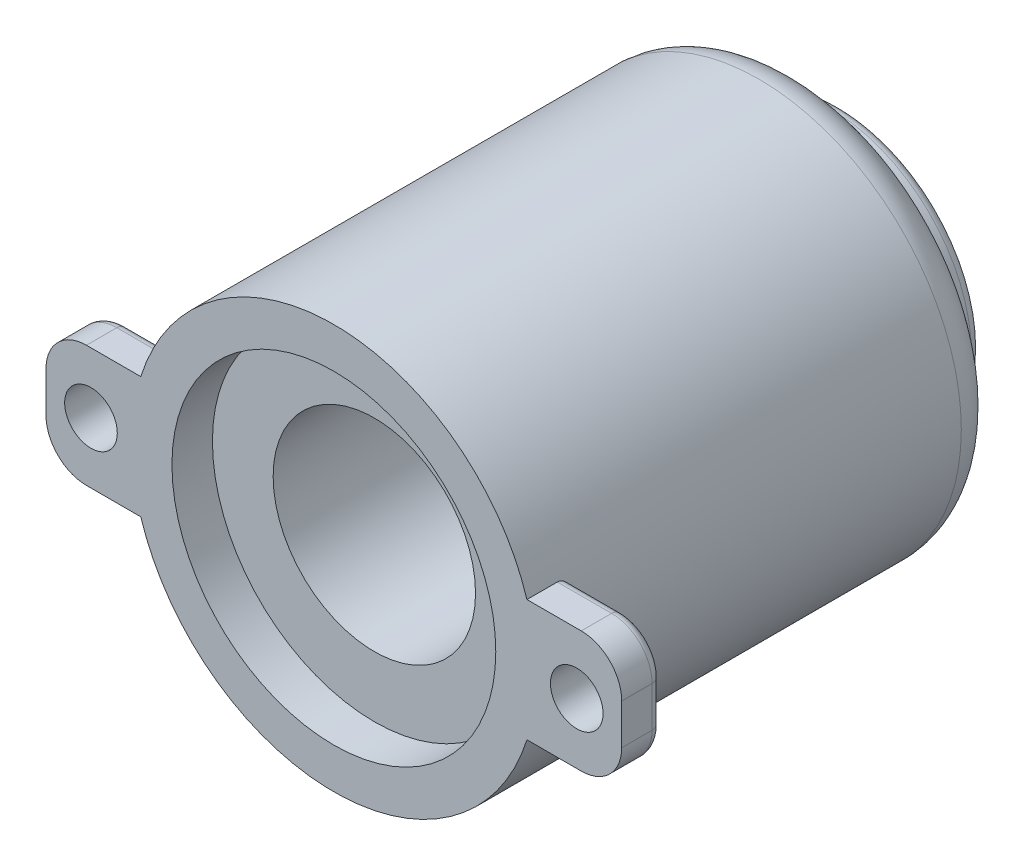
ISO-10303-21;
HEADER;
FILE_DESCRIPTION(('STEP AP214'),'2;1');
FILE_NAME('part.step','',(''),(''),'','','');
FILE_SCHEMA(('AUTOMOTIVE_DESIGN { 1 0 10303 214 1 1 1 1 }'));
ENDSEC;
DATA;
#1=APPLICATION_CONTEXT('core data for automotive mechanical design processes');
#2=APPLICATION_PROTOCOL_DEFINITION('international standard','automotive_design',2000,#1);
#3=PRODUCT_CONTEXT('',#1,'mechanical');
#4=PRODUCT('Part','Part','',(#3));
#5=PRODUCT_RELATED_PRODUCT_CATEGORY('part','',(#4));
#6=PRODUCT_DEFINITION_FORMATION('','',#4);
#7=PRODUCT_DEFINITION_CONTEXT('part definition',#1,'design');
#8=PRODUCT_DEFINITION('design','',#6,#7);
#9=PRODUCT_DEFINITION_SHAPE('','',#8);
#10=(LENGTH_UNIT() NAMED_UNIT(*) SI_UNIT(.MILLI.,.METRE.));
#11=(NAMED_UNIT(*) PLANE_ANGLE_UNIT() SI_UNIT($,.RADIAN.));
#12=(NAMED_UNIT(*) SI_UNIT($,.STERADIAN.) SOLID_ANGLE_UNIT());
#13=UNCERTAINTY_MEASURE_WITH_UNIT(LENGTH_MEASURE(1.E-05),#10,'distance_accuracy_value','');
#14=(GEOMETRIC_REPRESENTATION_CONTEXT(3) GLOBAL_UNCERTAINTY_ASSIGNED_CONTEXT((#13)) GLOBAL_UNIT_ASSIGNED_CONTEXT((#10,
#11,#12)) REPRESENTATION_CONTEXT('',''));
#15=CARTESIAN_POINT('',(0.,0.,0.));
#16=DIRECTION('',(0.,0.,1.));
#17=DIRECTION('',(1.,0.,0.));
#18=AXIS2_PLACEMENT_3D('',#15,#16,#17);
#19=CARTESIAN_POINT('',(0.,0.,25.));
#20=DIRECTION('',(0.,0.,-1.));
#21=DIRECTION('',(-1.,0.,0.));
#22=AXIS2_PLACEMENT_3D('',#19,#20,#21);
#23=CYLINDRICAL_SURFACE('',#22,10.);
#24=CARTESIAN_POINT('',(0.,0.,4.));
#25=DIRECTION('',(0.,0.,1.));
#26=DIRECTION('',(1.,0.,0.));
#27=AXIS2_PLACEMENT_3D('',#24,#25,#26);
#28=CIRCLE('',#27,10.);
#29=CARTESIAN_POINT('',(10.,0.,4.));
#30=VERTEX_POINT('',#29);
#31=EDGE_CURVE('E257',#30,#30,#28,.T.);
#32=ORIENTED_EDGE('',*,*,#31,.T.);
#33=EDGE_LOOP('',(#32));
#34=FACE_BOUND('',#33,.T.);
#35=CARTESIAN_POINT('',(0.,0.,23.));
#36=DIRECTION('',(0.,0.,1.));
#37=DIRECTION('',(1.,0.,0.));
#38=AXIS2_PLACEMENT_3D('',#35,#36,#37);
#39=CIRCLE('',#38,10.);
#40=CARTESIAN_POINT('',(9.68245836551854,-2.5,23.));
#41=VERTEX_POINT('',#40);
#42=CARTESIAN_POINT('',(9.68245836551854,2.5,23.));
#43=VERTEX_POINT('',#42);
#44=EDGE_CURVE('E202',#41,#43,#39,.T.);
#45=ORIENTED_EDGE('',*,*,#44,.F.);
#46=CARTESIAN_POINT('',(9.68245836551854,-2.5,23.));
#47=CARTESIAN_POINT('',(9.67496480250479,-2.52904312520752,22.9999809249249));
#48=CARTESIAN_POINT('',(9.66733257783533,-2.55804270438301,23.0025292417632));
#49=CARTESIAN_POINT('',(9.65203560335509,-2.61515873053145,23.0125843363903));
#50=CARTESIAN_POINT('',(9.6443708562301,-2.64327524887845,23.0200907123544));
#51=CARTESIAN_POINT('',(9.6292485010054,-2.69784793644394,23.0398906845954));
#52=CARTESIAN_POINT('',(9.62179100011823,-2.7243032548871,23.0521867110189));
#53=CARTESIAN_POINT('',(9.60735875051167,-2.77476938251723,23.0812531335548));
#54=CARTESIAN_POINT('',(9.60038386273843,-2.79878089677702,23.0980222340361));
#55=CARTESIAN_POINT('',(9.58725880346316,-2.8434145035181,23.1354367391875));
#56=CARTESIAN_POINT('',(9.58110130348199,-2.86406715053218,23.1560430573019));
#57=CARTESIAN_POINT('',(9.56980490864903,-2.90158903540323,23.2007069097613));
#58=CARTESIAN_POINT('',(9.56466606932191,-2.91845806703138,23.2247646321105));
#59=CARTESIAN_POINT('',(9.5558251694558,-2.94727419921496,23.2747269197597));
#60=CARTESIAN_POINT('',(9.55207820121579,-2.95937608351388,23.3005343437313));
#61=CARTESIAN_POINT('',(9.54596349204052,-2.97904150902355,23.3539625052951));
#62=CARTESIAN_POINT('',(9.54359402364106,-2.98661073480915,23.3815809231922));
#63=CARTESIAN_POINT('',(9.54111817225751,-2.99450689468364,23.424547371884));
#64=CARTESIAN_POINT('',(9.54047156850403,-2.99656561493198,23.4395667258843));
#65=CARTESIAN_POINT('',(9.53960853806577,-2.99931156393385,23.4697213938149));
#66=CARTESIAN_POINT('',(9.53939151438613,-3.00000069603307,23.4848565174323));
#67=CARTESIAN_POINT('',(9.53939201416956,-3.00000000000009,23.5));
#68=B_SPLINE_CURVE_WITH_KNOTS('',3,(#46,#47,#48,#49,#50,#51,#52,#53,#54,#55,#56,#57,#58,#59,#60,
#61,#62,#63,#64,#65,#66,#67),.UNSPECIFIED.,.F.,.F.,(4,2,2,2,2,2,2,2,2,2,4),(0.,
0.0898647569337993,0.179722231690332,0.269625357347482,0.35950247068271,0.448509731321384,
0.537521842190308,0.623342557815322,0.709055415854326,0.754515495626762,0.799912354261763),.UNSPECIFIED.);
#69=CARTESIAN_POINT('',(9.53939201416946,-3.,23.5));
#70=VERTEX_POINT('',#69);
#71=EDGE_CURVE('E321',#41,#70,#68,.T.);
#72=ORIENTED_EDGE('',*,*,#71,.T.);
#73=DIRECTION('',(0.,0.,1.));
#74=VECTOR('',#73,1.);
#75=CARTESIAN_POINT('',(9.53939201416946,-3.,23.));
#76=LINE('',#75,#74);
#77=CARTESIAN_POINT('',(9.53939201416946,-3.,25.));
#78=VERTEX_POINT('',#77);
#79=EDGE_CURVE('E210',#70,#78,#76,.T.);
#80=ORIENTED_EDGE('',*,*,#79,.T.);
#81=CARTESIAN_POINT('',(0.,0.,25.));
#82=DIRECTION('',(0.,0.,1.));
#83=DIRECTION('',(1.,0.,0.));
#84=AXIS2_PLACEMENT_3D('',#81,#82,#83);
#85=CIRCLE('',#84,10.);
#86=CARTESIAN_POINT('',(-9.53939201416946,-3.,25.));
#87=VERTEX_POINT('',#86);
#88=EDGE_CURVE('E255',#87,#78,#85,.T.);
#89=ORIENTED_EDGE('',*,*,#88,.F.);
#90=DIRECTION('',(0.,0.,1.));
#91=VECTOR('',#90,1.);
#92=CARTESIAN_POINT('',(-9.53939201416946,-3.,23.));
#93=LINE('',#92,#91);
#94=CARTESIAN_POINT('',(-9.53939201416946,-3.,23.5));
#95=VERTEX_POINT('',#94);
#96=EDGE_CURVE('E246',#95,#87,#93,.T.);
#97=ORIENTED_EDGE('',*,*,#96,.F.);
#98=CARTESIAN_POINT('',(-9.53939201416946,-3.,23.5));
#99=CARTESIAN_POINT('',(-9.53937998582246,-3.00002764626624,23.4727578056482));
#100=CARTESIAN_POINT('',(-9.5400915682234,-2.99777546092035,23.4455315693358));
#101=CARTESIAN_POINT('',(-9.54286960480183,-2.98892586751917,23.3919245130336));
#102=CARTESIAN_POINT('',(-9.54493309732231,-2.98233795768071,23.3655419769356));
#103=CARTESIAN_POINT('',(-9.55032323362511,-2.96503000267155,23.3143112637024));
#104=CARTESIAN_POINT('',(-9.55364982889329,-2.95431011620447,23.2894630276793));
#105=CARTESIAN_POINT('',(-9.56140799684489,-2.92910422732398,23.2419442946284));
#106=CARTESIAN_POINT('',(-9.56583982910627,-2.91461734015187,23.2192743109239));
#107=CARTESIAN_POINT('',(-9.57572561699523,-2.88197410245127,23.1762073585214));
#108=CARTESIAN_POINT('',(-9.58119952588392,-2.86374545894977,23.1558698413064));
#109=CARTESIAN_POINT('',(-9.59288472806633,-2.82435554424261,23.1185152404474));
#110=CARTESIAN_POINT('',(-9.59909623350931,-2.80319342901054,23.1014991158487));
#111=CARTESIAN_POINT('',(-9.61230665838635,-2.7575618993564,23.070518531096));
#112=CARTESIAN_POINT('',(-9.61932780455282,-2.73299025820295,23.056714176232));
#113=CARTESIAN_POINT('',(-9.63368018877332,-2.68195971484797,23.0334415953598));
#114=CARTESIAN_POINT('',(-9.64101137155978,-2.6555011484401,23.0239726000537));
#115=CARTESIAN_POINT('',(-9.6540821661106,-2.60752135624452,23.0112170875056));
#116=CARTESIAN_POINT('',(-9.65980746012515,-2.5862339165488,23.0070174499662));
#117=CARTESIAN_POINT('',(-9.67119906651014,-2.54330667204816,23.001408430675));
#118=CARTESIAN_POINT('',(-9.67686544055937,-2.52166731313824,22.9999957590679));
#119=CARTESIAN_POINT('',(-9.68245836551854,-2.5,23.));
#120=B_SPLINE_CURVE_WITH_KNOTS('',3,(#98,#99,#100,#101,#102,#103,#104,#105,#106,#107,#108,#109,
#110,#111,#112,#113,#114,#115,#116,#117,#118,#119),.UNSPECIFIED.,.F.,.F.,(4,2,2,2,2,2,2,2,2,2,
4),(0.,0.0815998783671246,0.163021589295217,0.244440173237377,0.325877897332737,
0.409069101079116,0.492284290698277,0.579030096370842,0.66576050326004,0.732911753892095,
0.799983688737135),.UNSPECIFIED.);
#121=CARTESIAN_POINT('',(-9.68245836551854,-2.5,23.));
#122=VERTEX_POINT('',#121);
#123=EDGE_CURVE('E44',#95,#122,#120,.T.);
#124=ORIENTED_EDGE('',*,*,#123,.T.);
#125=CARTESIAN_POINT('',(0.,0.,23.));
#126=DIRECTION('',(0.,0.,1.));
#127=DIRECTION('',(1.,0.,0.));
#128=AXIS2_PLACEMENT_3D('',#125,#126,#127);
#129=CIRCLE('',#128,10.);
#130=CARTESIAN_POINT('',(-9.68245836551854,2.5,23.));
#131=VERTEX_POINT('',#130);
#132=EDGE_CURVE('E216',#131,#122,#129,.T.);
#133=ORIENTED_EDGE('',*,*,#132,.F.);
#134=CARTESIAN_POINT('',(-9.68245836551854,2.5,23.));
#135=CARTESIAN_POINT('',(-9.67496480250479,2.52904312520752,22.9999809249249));
#136=CARTESIAN_POINT('',(-9.66733257783533,2.55804270438301,23.0025292417632));
#137=CARTESIAN_POINT('',(-9.65203560335509,2.61515873053145,23.0125843363903));
#138=CARTESIAN_POINT('',(-9.6443708562301,2.64327524887845,23.0200907123544));
#139=CARTESIAN_POINT('',(-9.6292485010054,2.69784793644394,23.0398906845954));
#140=CARTESIAN_POINT('',(-9.62179100011823,2.7243032548871,23.0521867110189));
#141=CARTESIAN_POINT('',(-9.60735875051167,2.77476938251723,23.0812531335548));
#142=CARTESIAN_POINT('',(-9.60038386273843,2.79878089677702,23.0980222340361));
#143=CARTESIAN_POINT('',(-9.58725880346316,2.8434145035181,23.1354367391875));
#144=CARTESIAN_POINT('',(-9.58110130348199,2.86406715053218,23.1560430573019));
#145=CARTESIAN_POINT('',(-9.56980490864903,2.90158903540323,23.2007069097613));
#146=CARTESIAN_POINT('',(-9.56466606932191,2.91845806703138,23.2247646321105));
#147=CARTESIAN_POINT('',(-9.5558251694558,2.94727419921496,23.2747269197597));
#148=CARTESIAN_POINT('',(-9.55207820121579,2.95937608351388,23.3005343437313));
#149=CARTESIAN_POINT('',(-9.54596349204052,2.97904150902355,23.3539625052951));
#150=CARTESIAN_POINT('',(-9.54359402364106,2.98661073480915,23.3815809231922));
#151=CARTESIAN_POINT('',(-9.54111817225751,2.99450689468364,23.424547371884));
#152=CARTESIAN_POINT('',(-9.54047156850403,2.99656561493198,23.4395667258843));
#153=CARTESIAN_POINT('',(-9.53960853806577,2.99931156393385,23.4697213938149));
#154=CARTESIAN_POINT('',(-9.53939151438613,3.00000069603307,23.4848565174323));
#155=CARTESIAN_POINT('',(-9.53939201416956,3.00000000000009,23.5));
#156=B_SPLINE_CURVE_WITH_KNOTS('',3,(#134,#135,#136,#137,#138,#139,#140,#141,#142,#143,#144,
#145,#146,#147,#148,#149,#150,#151,#152,#153,#154,#155),.UNSPECIFIED.,.F.,.F.,(4,2,2,2,2,2,2,2,
2,2,4),(0.,0.0898647569337993,0.179722231690332,0.269625357347482,0.35950247068271,
0.448509731321384,0.537521842190308,0.623342557815322,0.709055415854326,0.754515495626762,
0.799912354261763),.UNSPECIFIED.);
#157=CARTESIAN_POINT('',(-9.53939201416946,3.,23.5));
#158=VERTEX_POINT('',#157);
#159=EDGE_CURVE('E11',#131,#158,#156,.T.);
#160=ORIENTED_EDGE('',*,*,#159,.T.);
#161=DIRECTION('',(0.,0.,1.));
#162=VECTOR('',#161,1.);
#163=CARTESIAN_POINT('',(-9.53939201416946,3.,23.));
#164=LINE('',#163,#162);
#165=CARTESIAN_POINT('',(-9.53939201416946,3.,25.));
#166=VERTEX_POINT('',#165);
#167=EDGE_CURVE('E244',#158,#166,#164,.T.);
#168=ORIENTED_EDGE('',*,*,#167,.T.);
#169=CARTESIAN_POINT('',(9.53939201416946,3.,25.));
#170=VERTEX_POINT('',#169);
#171=EDGE_CURVE('E258',#170,#166,#85,.T.);
#172=ORIENTED_EDGE('',*,*,#171,.F.);
#173=DIRECTION('',(0.,0.,1.));
#174=VECTOR('',#173,1.);
#175=CARTESIAN_POINT('',(9.53939201416946,3.,23.));
#176=LINE('',#175,#174);
#177=CARTESIAN_POINT('',(9.53939201416946,3.,23.5));
#178=VERTEX_POINT('',#177);
#179=EDGE_CURVE('E172',#178,#170,#176,.T.);
#180=ORIENTED_EDGE('',*,*,#179,.F.);
#181=CARTESIAN_POINT('',(9.53939201416946,3.,23.5));
#182=CARTESIAN_POINT('',(9.53937998582246,3.00002764626624,23.4727578056482));
#183=CARTESIAN_POINT('',(9.5400915682234,2.99777546092035,23.4455315693358));
#184=CARTESIAN_POINT('',(9.54286960480183,2.98892586751917,23.3919245130336));
#185=CARTESIAN_POINT('',(9.54493309732231,2.98233795768071,23.3655419769356));
#186=CARTESIAN_POINT('',(9.55032323362511,2.96503000267155,23.3143112637024));
#187=CARTESIAN_POINT('',(9.55364982889329,2.95431011620447,23.2894630276793));
#188=CARTESIAN_POINT('',(9.56140799684489,2.92910422732398,23.2419442946284));
#189=CARTESIAN_POINT('',(9.56583982910627,2.91461734015187,23.2192743109239));
#190=CARTESIAN_POINT('',(9.57572561699523,2.88197410245127,23.1762073585214));
#191=CARTESIAN_POINT('',(9.58119952588392,2.86374545894977,23.1558698413064));
#192=CARTESIAN_POINT('',(9.59288472806633,2.82435554424261,23.1185152404474));
#193=CARTESIAN_POINT('',(9.59909623350931,2.80319342901054,23.1014991158487));
#194=CARTESIAN_POINT('',(9.61230665838635,2.7575618993564,23.070518531096));
#195=CARTESIAN_POINT('',(9.61932780455282,2.73299025820295,23.056714176232));
#196=CARTESIAN_POINT('',(9.63368018877332,2.68195971484797,23.0334415953598));
#197=CARTESIAN_POINT('',(9.64101137155978,2.6555011484401,23.0239726000537));
#198=CARTESIAN_POINT('',(9.6540821661106,2.60752135624452,23.0112170875056));
#199=CARTESIAN_POINT('',(9.65980746012515,2.5862339165488,23.0070174499662));
#200=CARTESIAN_POINT('',(9.67119906651014,2.54330667204816,23.001408430675));
#201=CARTESIAN_POINT('',(9.67686544055937,2.52166731313824,22.9999957590679));
#202=CARTESIAN_POINT('',(9.68245836551854,2.5,23.));
#203=B_SPLINE_CURVE_WITH_KNOTS('',3,(#181,#182,#183,#184,#185,#186,#187,#188,#189,#190,#191,
#192,#193,#194,#195,#196,#197,#198,#199,#200,#201,#202),.UNSPECIFIED.,.F.,.F.,(4,2,2,2,2,2,2,2,
2,2,4),(0.,0.0815998783671246,0.163021589295217,0.244440173237377,0.325877897332737,
0.409069101079116,0.492284290698277,0.579030096370842,0.66576050326004,0.732911753892095,
0.799983688737135),.UNSPECIFIED.);
#204=EDGE_CURVE('E328',#178,#43,#203,.T.);
#205=ORIENTED_EDGE('',*,*,#204,.T.);
#206=EDGE_LOOP('',(#45,#72,#80,#89,#97,#124,#133,#160,#168,#172,#180,#205));
#207=FACE_BOUND('',#206,.T.);
#208=ADVANCED_FACE('F35',(#34,#207),#23,.T.);
#209=CARTESIAN_POINT('',(0.,0.,25.));
#210=DIRECTION('',(0.,0.,-1.));
#211=DIRECTION('',(-1.,0.,0.));
#212=AXIS2_PLACEMENT_3D('',#209,#210,#211);
#213=CYLINDRICAL_SURFACE('',#212,5.);
#214=CARTESIAN_POINT('',(0.,0.,0.));
#215=DIRECTION('',(0.,0.,1.));
#216=DIRECTION('',(1.,0.,0.));
#217=AXIS2_PLACEMENT_3D('',#214,#215,#216);
#218=CIRCLE('',#217,5.);
#219=CARTESIAN_POINT('',(5.,0.,0.));
#220=VERTEX_POINT('',#219);
#221=EDGE_CURVE('E259',#220,#220,#218,.F.);
#222=ORIENTED_EDGE('',*,*,#221,.T.);
#223=EDGE_LOOP('',(#222));
#224=FACE_BOUND('',#223,.T.);
#225=CARTESIAN_POINT('',(0.,0.,23.));
#226=DIRECTION('',(0.,0.,1.));
#227=DIRECTION('',(1.,0.,0.));
#228=AXIS2_PLACEMENT_3D('',#225,#226,#227);
#229=CIRCLE('',#228,5.);
#230=CARTESIAN_POINT('',(5.,0.,23.));
#231=VERTEX_POINT('',#230);
#232=EDGE_CURVE('E252',#231,#231,#229,.T.);
#233=ORIENTED_EDGE('',*,*,#232,.T.);
#234=EDGE_LOOP('',(#233));
#235=FACE_BOUND('',#234,.T.);
#236=ADVANCED_FACE('F392',(#224,#235),#213,.F.);
#237=CARTESIAN_POINT('',(0.,0.,0.));
#238=DIRECTION('',(0.,0.,1.));
#239=DIRECTION('',(1.,0.,0.));
#240=AXIS2_PLACEMENT_3D('',#237,#238,#239);
#241=PLANE('',#240);
#242=CARTESIAN_POINT('',(0.,0.,0.));
#243=DIRECTION('',(0.,0.,1.));
#244=DIRECTION('',(1.,0.,0.));
#245=AXIS2_PLACEMENT_3D('',#242,#243,#244);
#246=CIRCLE('',#245,6.5);
#247=CARTESIAN_POINT('',(6.5,0.,0.));
#248=VERTEX_POINT('',#247);
#249=EDGE_CURVE('E312',#248,#248,#246,.F.);
#250=ORIENTED_EDGE('',*,*,#249,.T.);
#251=EDGE_LOOP('',(#250));
#252=FACE_BOUND('',#251,.T.);
#253=ORIENTED_EDGE('',*,*,#221,.F.);
#254=EDGE_LOOP('',(#253));
#255=FACE_BOUND('',#254,.T.);
#256=ADVANCED_FACE('F397',(#252,#255),#241,.F.);
#257=CARTESIAN_POINT('',(0.,0.,25.));
#258=DIRECTION('',(0.,0.,1.));
#259=DIRECTION('',(1.,0.,0.));
#260=AXIS2_PLACEMENT_3D('',#257,#258,#259);
#261=PLANE('',#260);
#262=CARTESIAN_POINT('',(0.,0.,25.));
#263=DIRECTION('',(0.,0.,1.));
#264=DIRECTION('',(1.,0.,0.));
#265=AXIS2_PLACEMENT_3D('',#262,#263,#264);
#266=CIRCLE('',#265,8.);
#267=CARTESIAN_POINT('',(8.,0.,25.));
#268=VERTEX_POINT('',#267);
#269=EDGE_CURVE('E239',#268,#268,#266,.T.);
#270=ORIENTED_EDGE('',*,*,#269,.F.);
#271=EDGE_LOOP('',(#270));
#272=FACE_BOUND('',#271,.T.);
#273=ORIENTED_EDGE('',*,*,#88,.T.);
#274=DIRECTION('',(-1.,0.,0.));
#275=VECTOR('',#274,1.);
#276=CARTESIAN_POINT('',(0.,-3.,25.));
#277=LINE('',#276,#275);
#278=CARTESIAN_POINT('',(12.2224676545555,-3.,25.));
#279=VERTEX_POINT('',#278);
#280=EDGE_CURVE('E190',#279,#78,#277,.T.);
#281=ORIENTED_EDGE('',*,*,#280,.F.);
#282=CARTESIAN_POINT('',(12.2224676545555,-1.,25.));
#283=DIRECTION('',(0.,0.,1.));
#284=DIRECTION('',(1.,0.,0.));
#285=AXIS2_PLACEMENT_3D('',#282,#283,#284);
#286=CIRCLE('',#285,2.);
#287=CARTESIAN_POINT('',(14.2224676545555,-0.999999999999986,25.));
#288=VERTEX_POINT('',#287);
#289=EDGE_CURVE('E193',#279,#288,#286,.T.);
#290=ORIENTED_EDGE('',*,*,#289,.T.);
#291=DIRECTION('',(0.,1.,0.));
#292=VECTOR('',#291,1.);
#293=CARTESIAN_POINT('',(14.2224676545555,0.,25.));
#294=LINE('',#293,#292);
#295=CARTESIAN_POINT('',(14.2224676545555,0.999999999999986,25.));
#296=VERTEX_POINT('',#295);
#297=EDGE_CURVE('E185',#288,#296,#294,.T.);
#298=ORIENTED_EDGE('',*,*,#297,.T.);
#299=CARTESIAN_POINT('',(12.2224676545555,1.,25.));
#300=DIRECTION('',(0.,0.,1.));
#301=DIRECTION('',(1.,0.,0.));
#302=AXIS2_PLACEMENT_3D('',#299,#300,#301);
#303=CIRCLE('',#302,2.);
#304=CARTESIAN_POINT('',(12.2224676545555,3.,25.));
#305=VERTEX_POINT('',#304);
#306=EDGE_CURVE('E165',#305,#296,#303,.F.);
#307=ORIENTED_EDGE('',*,*,#306,.F.);
#308=DIRECTION('',(-1.,0.,0.));
#309=VECTOR('',#308,1.);
#310=CARTESIAN_POINT('',(0.,3.,25.));
#311=LINE('',#310,#309);
#312=EDGE_CURVE('E181',#305,#170,#311,.T.);
#313=ORIENTED_EDGE('',*,*,#312,.T.);
#314=ORIENTED_EDGE('',*,*,#171,.T.);
#315=DIRECTION('',(1.,0.,0.));
#316=VECTOR('',#315,1.);
#317=CARTESIAN_POINT('',(0.,3.,25.));
#318=LINE('',#317,#316);
#319=CARTESIAN_POINT('',(-12.2224676545555,3.,25.));
#320=VERTEX_POINT('',#319);
#321=EDGE_CURVE('E229',#320,#166,#318,.T.);
#322=ORIENTED_EDGE('',*,*,#321,.F.);
#323=CARTESIAN_POINT('',(-12.2224676545555,1.,25.));
#324=DIRECTION('',(0.,0.,1.));
#325=DIRECTION('',(1.,0.,0.));
#326=AXIS2_PLACEMENT_3D('',#323,#324,#325);
#327=CIRCLE('',#326,2.);
#328=CARTESIAN_POINT('',(-14.2224676545555,0.999999999999986,25.));
#329=VERTEX_POINT('',#328);
#330=EDGE_CURVE('E232',#320,#329,#327,.T.);
#331=ORIENTED_EDGE('',*,*,#330,.T.);
#332=DIRECTION('',(0.,1.,0.));
#333=VECTOR('',#332,1.);
#334=CARTESIAN_POINT('',(-14.2224676545555,0.,25.));
#335=LINE('',#334,#333);
#336=CARTESIAN_POINT('',(-14.2224676545555,-0.999999999999986,25.));
#337=VERTEX_POINT('',#336);
#338=EDGE_CURVE('E217',#337,#329,#335,.T.);
#339=ORIENTED_EDGE('',*,*,#338,.F.);
#340=CARTESIAN_POINT('',(-12.2224676545555,-1.,25.));
#341=DIRECTION('',(0.,0.,1.));
#342=DIRECTION('',(1.,0.,0.));
#343=AXIS2_PLACEMENT_3D('',#340,#341,#342);
#344=CIRCLE('',#343,2.);
#345=CARTESIAN_POINT('',(-12.2224676545555,-3.,25.));
#346=VERTEX_POINT('',#345);
#347=EDGE_CURVE('E223',#346,#337,#344,.F.);
#348=ORIENTED_EDGE('',*,*,#347,.F.);
#349=DIRECTION('',(1.,0.,0.));
#350=VECTOR('',#349,1.);
#351=CARTESIAN_POINT('',(0.,-3.,25.));
#352=LINE('',#351,#350);
#353=EDGE_CURVE('E226',#346,#87,#352,.T.);
#354=ORIENTED_EDGE('',*,*,#353,.T.);
#355=EDGE_LOOP('',(#273,#281,#290,#298,#307,#313,#314,#322,#331,#339,#348,#354));
#356=FACE_BOUND('',#355,.T.);
#357=CARTESIAN_POINT('',(-12.,0.,25.));
#358=DIRECTION('',(0.,0.,1.));
#359=DIRECTION('',(1.,0.,0.));
#360=AXIS2_PLACEMENT_3D('',#357,#358,#359);
#361=CIRCLE('',#360,1.3);
#362=CARTESIAN_POINT('',(-10.7,0.,25.));
#363=VERTEX_POINT('',#362);
#364=EDGE_CURVE('E205',#363,#363,#361,.T.);
#365=ORIENTED_EDGE('',*,*,#364,.F.);
#366=EDGE_LOOP('',(#365));
#367=FACE_BOUND('',#366,.T.);
#368=CARTESIAN_POINT('',(12.,0.,25.));
#369=DIRECTION('',(0.,0.,1.));
#370=DIRECTION('',(1.,0.,0.));
#371=AXIS2_PLACEMENT_3D('',#368,#369,#370);
#372=CIRCLE('',#371,1.3);
#373=CARTESIAN_POINT('',(13.3,0.,25.));
#374=VERTEX_POINT('',#373);
#375=EDGE_CURVE('E199',#374,#374,#372,.F.);
#376=ORIENTED_EDGE('',*,*,#375,.T.);
#377=EDGE_LOOP('',(#376));
#378=FACE_BOUND('',#377,.T.);
#379=ADVANCED_FACE('F178',(#272,#356,#367,#378),#261,.T.);
#380=CARTESIAN_POINT('',(0.,0.,2.));
#381=DIRECTION('',(0.,0.,-1.));
#382=DIRECTION('',(-1.,0.,0.));
#383=AXIS2_PLACEMENT_3D('',#380,#381,#382);
#384=CYLINDRICAL_SURFACE('',#383,7.);
#385=CARTESIAN_POINT('',(0.,0.,0.5));
#386=DIRECTION('',(0.,0.,1.));
#387=DIRECTION('',(1.,0.,0.));
#388=AXIS2_PLACEMENT_3D('',#385,#386,#387);
#389=CIRCLE('',#388,7.);
#390=CARTESIAN_POINT('',(7.,0.,0.5));
#391=VERTEX_POINT('',#390);
#392=EDGE_CURVE('E309',#391,#391,#389,.T.);
#393=ORIENTED_EDGE('',*,*,#392,.T.);
#394=EDGE_LOOP('',(#393));
#395=FACE_BOUND('',#394,.T.);
#396=CARTESIAN_POINT('',(0.,0.,1.5));
#397=DIRECTION('',(0.,0.,1.));
#398=DIRECTION('',(1.,0.,0.));
#399=AXIS2_PLACEMENT_3D('',#396,#397,#398);
#400=CIRCLE('',#399,7.);
#401=CARTESIAN_POINT('',(7.,0.,1.5));
#402=VERTEX_POINT('',#401);
#403=EDGE_CURVE('E306',#402,#402,#400,.F.);
#404=ORIENTED_EDGE('',*,*,#403,.T.);
#405=EDGE_LOOP('',(#404));
#406=FACE_BOUND('',#405,.T.);
#407=ADVANCED_FACE('F478',(#395,#406),#384,.T.);
#408=CARTESIAN_POINT('',(0.,0.,2.));
#409=DIRECTION('',(0.,0.,1.));
#410=DIRECTION('',(1.,0.,0.));
#411=AXIS2_PLACEMENT_3D('',#408,#409,#410);
#412=PLANE('',#411);
#413=CARTESIAN_POINT('',(0.,0.,2.));
#414=DIRECTION('',(0.,0.,1.));
#415=DIRECTION('',(1.,0.,0.));
#416=AXIS2_PLACEMENT_3D('',#413,#414,#415);
#417=CIRCLE('',#416,7.5);
#418=CARTESIAN_POINT('',(7.5,0.,2.));
#419=VERTEX_POINT('',#418);
#420=EDGE_CURVE('E315',#419,#419,#417,.T.);
#421=ORIENTED_EDGE('',*,*,#420,.T.);
#422=EDGE_LOOP('',(#421));
#423=FACE_BOUND('',#422,.T.);
#424=CARTESIAN_POINT('',(0.,0.,2.));
#425=DIRECTION('',(0.,0.,1.));
#426=DIRECTION('',(1.,0.,0.));
#427=AXIS2_PLACEMENT_3D('',#424,#425,#426);
#428=CIRCLE('',#427,8.);
#429=CARTESIAN_POINT('',(8.,0.,2.));
#430=VERTEX_POINT('',#429);
#431=EDGE_CURVE('E266',#430,#430,#428,.F.);
#432=ORIENTED_EDGE('',*,*,#431,.T.);
#433=EDGE_LOOP('',(#432));
#434=FACE_BOUND('',#433,.T.);
#435=ADVANCED_FACE('F474',(#423,#434),#412,.F.);
#436=CARTESIAN_POINT('',(0.,0.,23.));
#437=DIRECTION('',(0.,0.,1.));
#438=DIRECTION('',(1.,0.,0.));
#439=AXIS2_PLACEMENT_3D('',#436,#437,#438);
#440=CYLINDRICAL_SURFACE('',#439,8.);
#441=CARTESIAN_POINT('',(0.,0.,23.));
#442=DIRECTION('',(0.,0.,1.));
#443=DIRECTION('',(1.,0.,0.));
#444=AXIS2_PLACEMENT_3D('',#441,#442,#443);
#445=CIRCLE('',#444,8.);
#446=CARTESIAN_POINT('',(8.,0.,23.));
#447=VERTEX_POINT('',#446);
#448=EDGE_CURVE('E249',#447,#447,#445,.T.);
#449=ORIENTED_EDGE('',*,*,#448,.F.);
#450=EDGE_LOOP('',(#449));
#451=FACE_BOUND('',#450,.T.);
#452=ORIENTED_EDGE('',*,*,#269,.T.);
#453=EDGE_LOOP('',(#452));
#454=FACE_BOUND('',#453,.T.);
#455=ADVANCED_FACE('F470',(#451,#454),#440,.F.);
#456=CARTESIAN_POINT('',(0.,0.,23.));
#457=DIRECTION('',(0.,0.,1.));
#458=DIRECTION('',(1.,0.,0.));
#459=AXIS2_PLACEMENT_3D('',#456,#457,#458);
#460=PLANE('',#459);
#461=ORIENTED_EDGE('',*,*,#232,.F.);
#462=EDGE_LOOP('',(#461));
#463=FACE_BOUND('',#462,.T.);
#464=ORIENTED_EDGE('',*,*,#448,.T.);
#465=EDGE_LOOP('',(#464));
#466=FACE_BOUND('',#465,.T.);
#467=ADVANCED_FACE('F463',(#463,#466),#460,.T.);
#468=CARTESIAN_POINT('',(-12.2224676545555,-1.,23.));
#469=DIRECTION('',(0.,0.,1.));
#470=DIRECTION('',(1.,0.,0.));
#471=AXIS2_PLACEMENT_3D('',#468,#469,#470);
#472=CYLINDRICAL_SURFACE('',#471,2.);
#473=DIRECTION('',(0.,0.,1.));
#474=VECTOR('',#473,1.);
#475=CARTESIAN_POINT('',(-14.2224676545555,-0.999999999999986,23.));
#476=LINE('',#475,#474);
#477=CARTESIAN_POINT('',(-14.2224676545555,-0.999999999999986,23.5));
#478=VERTEX_POINT('',#477);
#479=EDGE_CURVE('E237',#478,#337,#476,.T.);
#480=ORIENTED_EDGE('',*,*,#479,.F.);
#481=CARTESIAN_POINT('',(-12.2224676545555,-1.,23.5));
#482=DIRECTION('',(0.,0.,1.));
#483=DIRECTION('',(1.,0.,0.));
#484=AXIS2_PLACEMENT_3D('',#481,#482,#483);
#485=CIRCLE('',#484,2.);
#486=CARTESIAN_POINT('',(-12.2224676545555,-3.,23.5));
#487=VERTEX_POINT('',#486);
#488=EDGE_CURVE('E300',#478,#487,#485,.T.);
#489=ORIENTED_EDGE('',*,*,#488,.T.);
#490=DIRECTION('',(0.,0.,1.));
#491=VECTOR('',#490,1.);
#492=CARTESIAN_POINT('',(-12.2224676545555,-3.,23.));
#493=LINE('',#492,#491);
#494=EDGE_CURVE('E220',#487,#346,#493,.T.);
#495=ORIENTED_EDGE('',*,*,#494,.T.);
#496=ORIENTED_EDGE('',*,*,#347,.T.);
#497=EDGE_LOOP('',(#480,#489,#495,#496));
#498=FACE_BOUND('',#497,.T.);
#499=ADVANCED_FACE('F449',(#498),#472,.T.);
#500=CARTESIAN_POINT('',(-14.2224676545555,0.,23.));
#501=DIRECTION('',(1.,0.,0.));
#502=DIRECTION('',(0.,0.,-1.));
#503=AXIS2_PLACEMENT_3D('',#500,#501,#502);
#504=PLANE('',#503);
#505=DIRECTION('',(0.,0.,1.));
#506=VECTOR('',#505,1.);
#507=CARTESIAN_POINT('',(-14.2224676545555,0.999999999999986,23.));
#508=LINE('',#507,#506);
#509=CARTESIAN_POINT('',(-14.2224676545555,0.999999999999986,23.5));
#510=VERTEX_POINT('',#509);
#511=EDGE_CURVE('E240',#510,#329,#508,.T.);
#512=ORIENTED_EDGE('',*,*,#511,.F.);
#513=DIRECTION('',(0.,1.,0.));
#514=VECTOR('',#513,1.);
#515=CARTESIAN_POINT('',(-14.2224676545555,0.,23.5));
#516=LINE('',#515,#514);
#517=EDGE_CURVE('E302',#510,#478,#516,.F.);
#518=ORIENTED_EDGE('',*,*,#517,.T.);
#519=ORIENTED_EDGE('',*,*,#479,.T.);
#520=ORIENTED_EDGE('',*,*,#338,.T.);
#521=EDGE_LOOP('',(#512,#518,#519,#520));
#522=FACE_BOUND('',#521,.T.);
#523=ADVANCED_FACE('F445',(#522),#504,.F.);
#524=CARTESIAN_POINT('',(-12.2224676545555,1.,23.));
#525=DIRECTION('',(0.,0.,1.));
#526=DIRECTION('',(1.,0.,0.));
#527=AXIS2_PLACEMENT_3D('',#524,#525,#526);
#528=CYLINDRICAL_SURFACE('',#527,2.);
#529=DIRECTION('',(0.,0.,1.));
#530=VECTOR('',#529,1.);
#531=CARTESIAN_POINT('',(-12.2224676545555,3.,23.));
#532=LINE('',#531,#530);
#533=CARTESIAN_POINT('',(-12.2224676545555,3.,23.5));
#534=VERTEX_POINT('',#533);
#535=EDGE_CURVE('E242',#534,#320,#532,.T.);
#536=ORIENTED_EDGE('',*,*,#535,.F.);
#537=CARTESIAN_POINT('',(-12.2224676545555,1.,23.5));
#538=DIRECTION('',(0.,0.,1.));
#539=DIRECTION('',(1.,0.,0.));
#540=AXIS2_PLACEMENT_3D('',#537,#538,#539);
#541=CIRCLE('',#540,2.);
#542=EDGE_CURVE('E304',#534,#510,#541,.T.);
#543=ORIENTED_EDGE('',*,*,#542,.T.);
#544=ORIENTED_EDGE('',*,*,#511,.T.);
#545=ORIENTED_EDGE('',*,*,#330,.F.);
#546=EDGE_LOOP('',(#536,#543,#544,#545));
#547=FACE_BOUND('',#546,.T.);
#548=ADVANCED_FACE('F448',(#547),#528,.T.);
#549=CARTESIAN_POINT('',(0.,3.,23.));
#550=DIRECTION('',(0.,-1.,0.));
#551=DIRECTION('',(0.,0.,-1.));
#552=AXIS2_PLACEMENT_3D('',#549,#550,#551);
#553=PLANE('',#552);
#554=ORIENTED_EDGE('',*,*,#167,.F.);
#555=DIRECTION('',(1.,0.,0.));
#556=VECTOR('',#555,1.);
#557=CARTESIAN_POINT('',(0.,3.,23.5));
#558=LINE('',#557,#556);
#559=EDGE_CURVE('E57',#158,#534,#558,.F.);
#560=ORIENTED_EDGE('',*,*,#559,.T.);
#561=ORIENTED_EDGE('',*,*,#535,.T.);
#562=ORIENTED_EDGE('',*,*,#321,.T.);
#563=EDGE_LOOP('',(#554,#560,#561,#562));
#564=FACE_BOUND('',#563,.T.);
#565=ADVANCED_FACE('F453',(#564),#553,.F.);
#566=CARTESIAN_POINT('',(-12.,0.,23.));
#567=DIRECTION('',(0.,0.,1.));
#568=DIRECTION('',(1.,0.,0.));
#569=AXIS2_PLACEMENT_3D('',#566,#567,#568);
#570=CYLINDRICAL_SURFACE('',#569,1.3);
#571=CARTESIAN_POINT('',(-12.,0.,23.));
#572=DIRECTION('',(0.,0.,1.));
#573=DIRECTION('',(1.,0.,0.));
#574=AXIS2_PLACEMENT_3D('',#571,#572,#573);
#575=CIRCLE('',#574,1.3);
#576=CARTESIAN_POINT('',(-10.7,0.,23.));
#577=VERTEX_POINT('',#576);
#578=EDGE_CURVE('E213',#577,#577,#575,.T.);
#579=ORIENTED_EDGE('',*,*,#578,.F.);
#580=EDGE_LOOP('',(#579));
#581=FACE_BOUND('',#580,.T.);
#582=ORIENTED_EDGE('',*,*,#364,.T.);
#583=EDGE_LOOP('',(#582));
#584=FACE_BOUND('',#583,.T.);
#585=ADVANCED_FACE('F457',(#581,#584),#570,.F.);
#586=CARTESIAN_POINT('',(0.,-3.,23.));
#587=DIRECTION('',(0.,-1.,0.));
#588=DIRECTION('',(0.,0.,-1.));
#589=AXIS2_PLACEMENT_3D('',#586,#587,#588);
#590=PLANE('',#589);
#591=ORIENTED_EDGE('',*,*,#494,.F.);
#592=DIRECTION('',(1.,0.,0.));
#593=VECTOR('',#592,1.);
#594=CARTESIAN_POINT('',(-9.53939201416946,-3.,23.5));
#595=LINE('',#594,#593);
#596=EDGE_CURVE('E287',#487,#95,#595,.T.);
#597=ORIENTED_EDGE('',*,*,#596,.T.);
#598=ORIENTED_EDGE('',*,*,#96,.T.);
#599=ORIENTED_EDGE('',*,*,#353,.F.);
#600=EDGE_LOOP('',(#591,#597,#598,#599));
#601=FACE_BOUND('',#600,.T.);
#602=ADVANCED_FACE('F443',(#601),#590,.T.);
#603=CARTESIAN_POINT('',(0.,0.,23.));
#604=DIRECTION('',(0.,0.,1.));
#605=DIRECTION('',(1.,0.,0.));
#606=AXIS2_PLACEMENT_3D('',#603,#604,#605);
#607=PLANE('',#606);
#608=ORIENTED_EDGE('',*,*,#578,.T.);
#609=EDGE_LOOP('',(#608));
#610=FACE_BOUND('',#609,.T.);
#611=ORIENTED_EDGE('',*,*,#132,.T.);
#612=DIRECTION('',(1.,0.,0.));
#613=VECTOR('',#612,1.);
#614=CARTESIAN_POINT('',(-12.2224676545555,-2.5,23.));
#615=LINE('',#614,#613);
#616=CARTESIAN_POINT('',(-12.2224676545555,-2.5,23.));
#617=VERTEX_POINT('',#616);
#618=EDGE_CURVE('E298',#122,#617,#615,.F.);
#619=ORIENTED_EDGE('',*,*,#618,.T.);
#620=CARTESIAN_POINT('',(-12.2224676545555,-1.,23.));
#621=DIRECTION('',(0.,0.,1.));
#622=DIRECTION('',(1.,0.,0.));
#623=AXIS2_PLACEMENT_3D('',#620,#621,#622);
#624=CIRCLE('',#623,1.5);
#625=CARTESIAN_POINT('',(-13.7224676545555,-0.999999999999989,23.));
#626=VERTEX_POINT('',#625);
#627=EDGE_CURVE('E296',#617,#626,#624,.F.);
#628=ORIENTED_EDGE('',*,*,#627,.T.);
#629=DIRECTION('',(0.,1.,0.));
#630=VECTOR('',#629,1.);
#631=CARTESIAN_POINT('',(-13.7224676545555,0.,23.));
#632=LINE('',#631,#630);
#633=CARTESIAN_POINT('',(-13.7224676545555,0.999999999999986,23.));
#634=VERTEX_POINT('',#633);
#635=EDGE_CURVE('E294',#626,#634,#632,.T.);
#636=ORIENTED_EDGE('',*,*,#635,.T.);
#637=CARTESIAN_POINT('',(-12.2224676545555,1.,23.));
#638=DIRECTION('',(0.,0.,1.));
#639=DIRECTION('',(1.,0.,0.));
#640=AXIS2_PLACEMENT_3D('',#637,#638,#639);
#641=CIRCLE('',#640,1.5);
#642=CARTESIAN_POINT('',(-12.2224676545555,2.5,23.));
#643=VERTEX_POINT('',#642);
#644=EDGE_CURVE('E292',#634,#643,#641,.F.);
#645=ORIENTED_EDGE('',*,*,#644,.T.);
#646=DIRECTION('',(1.,0.,0.));
#647=VECTOR('',#646,1.);
#648=CARTESIAN_POINT('',(0.,2.5,23.));
#649=LINE('',#648,#647);
#650=EDGE_CURVE('E290',#643,#131,#649,.T.);
#651=ORIENTED_EDGE('',*,*,#650,.T.);
#652=EDGE_LOOP('',(#611,#619,#628,#636,#645,#651));
#653=FACE_BOUND('',#652,.T.);
#654=ADVANCED_FACE('F440',(#610,#653),#607,.F.);
#655=CARTESIAN_POINT('',(12.2224676545555,1.,23.));
#656=DIRECTION('',(0.,0.,1.));
#657=DIRECTION('',(1.,0.,0.));
#658=AXIS2_PLACEMENT_3D('',#655,#656,#657);
#659=CYLINDRICAL_SURFACE('',#658,2.);
#660=DIRECTION('',(0.,0.,1.));
#661=VECTOR('',#660,1.);
#662=CARTESIAN_POINT('',(14.2224676545555,0.999999999999986,23.));
#663=LINE('',#662,#661);
#664=CARTESIAN_POINT('',(14.2224676545555,0.999999999999986,23.5));
#665=VERTEX_POINT('',#664);
#666=EDGE_CURVE('E203',#665,#296,#663,.T.);
#667=ORIENTED_EDGE('',*,*,#666,.F.);
#668=CARTESIAN_POINT('',(12.2224676545555,1.,23.5));
#669=DIRECTION('',(0.,0.,1.));
#670=DIRECTION('',(1.,0.,0.));
#671=AXIS2_PLACEMENT_3D('',#668,#669,#670);
#672=CIRCLE('',#671,2.);
#673=CARTESIAN_POINT('',(12.2224676545555,3.,23.5));
#674=VERTEX_POINT('',#673);
#675=EDGE_CURVE('E168',#665,#674,#672,.T.);
#676=ORIENTED_EDGE('',*,*,#675,.T.);
#677=DIRECTION('',(0.,0.,1.));
#678=VECTOR('',#677,1.);
#679=CARTESIAN_POINT('',(12.2224676545555,3.,23.));
#680=LINE('',#679,#678);
#681=EDGE_CURVE('E161',#674,#305,#680,.T.);
#682=ORIENTED_EDGE('',*,*,#681,.T.);
#683=ORIENTED_EDGE('',*,*,#306,.T.);
#684=EDGE_LOOP('',(#667,#676,#682,#683));
#685=FACE_BOUND('',#684,.T.);
#686=ADVANCED_FACE('F164',(#685),#659,.T.);
#687=CARTESIAN_POINT('',(14.2224676545555,0.,23.));
#688=DIRECTION('',(1.,0.,0.));
#689=DIRECTION('',(0.,0.,-1.));
#690=AXIS2_PLACEMENT_3D('',#687,#688,#689);
#691=PLANE('',#690);
#692=DIRECTION('',(0.,0.,1.));
#693=VECTOR('',#692,1.);
#694=CARTESIAN_POINT('',(14.2224676545555,-0.999999999999986,23.));
#695=LINE('',#694,#693);
#696=CARTESIAN_POINT('',(14.2224676545555,-0.999999999999986,23.5));
#697=VERTEX_POINT('',#696);
#698=EDGE_CURVE('E206',#697,#288,#695,.T.);
#699=ORIENTED_EDGE('',*,*,#698,.F.);
#700=DIRECTION('',(0.,1.,0.));
#701=VECTOR('',#700,1.);
#702=CARTESIAN_POINT('',(14.2224676545555,0.999999999999986,23.5));
#703=LINE('',#702,#701);
#704=EDGE_CURVE('E318',#697,#665,#703,.T.);
#705=ORIENTED_EDGE('',*,*,#704,.T.);
#706=ORIENTED_EDGE('',*,*,#666,.T.);
#707=ORIENTED_EDGE('',*,*,#297,.F.);
#708=EDGE_LOOP('',(#699,#705,#706,#707));
#709=FACE_BOUND('',#708,.T.);
#710=ADVANCED_FACE('F424',(#709),#691,.T.);
#711=CARTESIAN_POINT('',(12.2224676545555,-1.,23.));
#712=DIRECTION('',(0.,0.,1.));
#713=DIRECTION('',(1.,0.,0.));
#714=AXIS2_PLACEMENT_3D('',#711,#712,#713);
#715=CYLINDRICAL_SURFACE('',#714,2.);
#716=DIRECTION('',(0.,0.,1.));
#717=VECTOR('',#716,1.);
#718=CARTESIAN_POINT('',(12.2224676545555,-3.,23.));
#719=LINE('',#718,#717);
#720=CARTESIAN_POINT('',(12.2224676545555,-3.,23.5));
#721=VERTEX_POINT('',#720);
#722=EDGE_CURVE('E208',#721,#279,#719,.T.);
#723=ORIENTED_EDGE('',*,*,#722,.F.);
#724=CARTESIAN_POINT('',(12.2224676545555,-1.,23.5));
#725=DIRECTION('',(0.,0.,1.));
#726=DIRECTION('',(1.,0.,0.));
#727=AXIS2_PLACEMENT_3D('',#724,#725,#726);
#728=CIRCLE('',#727,2.);
#729=EDGE_CURVE('E282',#721,#697,#728,.T.);
#730=ORIENTED_EDGE('',*,*,#729,.T.);
#731=ORIENTED_EDGE('',*,*,#698,.T.);
#732=ORIENTED_EDGE('',*,*,#289,.F.);
#733=EDGE_LOOP('',(#723,#730,#731,#732));
#734=FACE_BOUND('',#733,.T.);
#735=ADVANCED_FACE('F427',(#734),#715,.T.);
#736=CARTESIAN_POINT('',(0.,-3.,23.));
#737=DIRECTION('',(0.,1.,0.));
#738=DIRECTION('',(0.,0.,1.));
#739=AXIS2_PLACEMENT_3D('',#736,#737,#738);
#740=PLANE('',#739);
#741=ORIENTED_EDGE('',*,*,#79,.F.);
#742=DIRECTION('',(-1.,0.,0.));
#743=VECTOR('',#742,1.);
#744=CARTESIAN_POINT('',(0.,-3.,23.5));
#745=LINE('',#744,#743);
#746=EDGE_CURVE('E280',#70,#721,#745,.F.);
#747=ORIENTED_EDGE('',*,*,#746,.T.);
#748=ORIENTED_EDGE('',*,*,#722,.T.);
#749=ORIENTED_EDGE('',*,*,#280,.T.);
#750=EDGE_LOOP('',(#741,#747,#748,#749));
#751=FACE_BOUND('',#750,.T.);
#752=ADVANCED_FACE('F431',(#751),#740,.F.);
#753=CARTESIAN_POINT('',(0.,3.,23.));
#754=DIRECTION('',(0.,1.,0.));
#755=DIRECTION('',(0.,0.,1.));
#756=AXIS2_PLACEMENT_3D('',#753,#754,#755);
#757=PLANE('',#756);
#758=ORIENTED_EDGE('',*,*,#681,.F.);
#759=DIRECTION('',(-1.,0.,0.));
#760=VECTOR('',#759,1.);
#761=CARTESIAN_POINT('',(9.53939201416946,3.,23.5));
#762=LINE('',#761,#760);
#763=EDGE_CURVE('E284',#674,#178,#762,.T.);
#764=ORIENTED_EDGE('',*,*,#763,.T.);
#765=ORIENTED_EDGE('',*,*,#179,.T.);
#766=ORIENTED_EDGE('',*,*,#312,.F.);
#767=EDGE_LOOP('',(#758,#764,#765,#766));
#768=FACE_BOUND('',#767,.T.);
#769=ADVANCED_FACE('F188',(#768),#757,.T.);
#770=CARTESIAN_POINT('',(12.,0.,23.));
#771=DIRECTION('',(0.,0.,1.));
#772=DIRECTION('',(1.,0.,0.));
#773=AXIS2_PLACEMENT_3D('',#770,#771,#772);
#774=CYLINDRICAL_SURFACE('',#773,1.3);
#775=CARTESIAN_POINT('',(12.,0.,23.));
#776=DIRECTION('',(0.,0.,1.));
#777=DIRECTION('',(1.,0.,0.));
#778=AXIS2_PLACEMENT_3D('',#775,#776,#777);
#779=CIRCLE('',#778,1.3);
#780=CARTESIAN_POINT('',(13.3,0.,23.));
#781=VERTEX_POINT('',#780);
#782=EDGE_CURVE('E173',#781,#781,#779,.F.);
#783=ORIENTED_EDGE('',*,*,#782,.T.);
#784=EDGE_LOOP('',(#783));
#785=FACE_BOUND('',#784,.T.);
#786=ORIENTED_EDGE('',*,*,#375,.F.);
#787=EDGE_LOOP('',(#786));
#788=FACE_BOUND('',#787,.T.);
#789=ADVANCED_FACE('F411',(#785,#788),#774,.F.);
#790=CARTESIAN_POINT('',(0.,0.,23.));
#791=DIRECTION('',(0.,0.,1.));
#792=DIRECTION('',(1.,0.,0.));
#793=AXIS2_PLACEMENT_3D('',#790,#791,#792);
#794=PLANE('',#793);
#795=CARTESIAN_POINT('',(12.2224676545555,-1.,23.));
#796=DIRECTION('',(0.,0.,1.));
#797=DIRECTION('',(1.,0.,0.));
#798=AXIS2_PLACEMENT_3D('',#795,#796,#797);
#799=CIRCLE('',#798,1.5);
#800=CARTESIAN_POINT('',(13.7224676545555,-0.999999999999989,23.));
#801=VERTEX_POINT('',#800);
#802=CARTESIAN_POINT('',(12.2224676545555,-2.5,23.));
#803=VERTEX_POINT('',#802);
#804=EDGE_CURVE('E275',#801,#803,#799,.F.);
#805=ORIENTED_EDGE('',*,*,#804,.T.);
#806=DIRECTION('',(-1.,0.,0.));
#807=VECTOR('',#806,1.);
#808=CARTESIAN_POINT('',(0.,-2.5,23.));
#809=LINE('',#808,#807);
#810=EDGE_CURVE('E277',#803,#41,#809,.T.);
#811=ORIENTED_EDGE('',*,*,#810,.T.);
#812=ORIENTED_EDGE('',*,*,#44,.T.);
#813=DIRECTION('',(-1.,0.,0.));
#814=VECTOR('',#813,1.);
#815=CARTESIAN_POINT('',(12.2224676545555,2.5,23.));
#816=LINE('',#815,#814);
#817=CARTESIAN_POINT('',(12.2224676545555,2.5,23.));
#818=VERTEX_POINT('',#817);
#819=EDGE_CURVE('E273',#43,#818,#816,.F.);
#820=ORIENTED_EDGE('',*,*,#819,.T.);
#821=CARTESIAN_POINT('',(12.2224676545555,1.,23.));
#822=DIRECTION('',(0.,0.,1.));
#823=DIRECTION('',(1.,0.,0.));
#824=AXIS2_PLACEMENT_3D('',#821,#822,#823);
#825=CIRCLE('',#824,1.5);
#826=CARTESIAN_POINT('',(13.7224676545555,0.999999999999989,23.));
#827=VERTEX_POINT('',#826);
#828=EDGE_CURVE('E271',#818,#827,#825,.F.);
#829=ORIENTED_EDGE('',*,*,#828,.T.);
#830=DIRECTION('',(0.,1.,0.));
#831=VECTOR('',#830,1.);
#832=CARTESIAN_POINT('',(13.7224676545555,-0.999999999999986,23.));
#833=LINE('',#832,#831);
#834=EDGE_CURVE('E269',#827,#801,#833,.F.);
#835=ORIENTED_EDGE('',*,*,#834,.T.);
#836=EDGE_LOOP('',(#805,#811,#812,#820,#829,#835));
#837=FACE_BOUND('',#836,.T.);
#838=ORIENTED_EDGE('',*,*,#782,.F.);
#839=EDGE_LOOP('',(#838));
#840=FACE_BOUND('',#839,.T.);
#841=ADVANCED_FACE('F414',(#837,#840),#794,.F.);
#842=CARTESIAN_POINT('',(0.,0.,4.));
#843=DIRECTION('',(0.,0.,1.));
#844=DIRECTION('',(1.,0.,0.));
#845=AXIS2_PLACEMENT_3D('',#842,#843,#844);
#846=TOROIDAL_SURFACE('',#845,8.,2.);
#847=ORIENTED_EDGE('',*,*,#431,.F.);
#848=EDGE_LOOP('',(#847));
#849=FACE_BOUND('',#848,.T.);
#850=ORIENTED_EDGE('',*,*,#31,.F.);
#851=EDGE_LOOP('',(#850));
#852=FACE_BOUND('',#851,.T.);
#853=ADVANCED_FACE('F344',(#849,#852),#846,.T.);
#854=CARTESIAN_POINT('',(0.,2.5,23.5));
#855=DIRECTION('',(1.,0.,0.));
#856=DIRECTION('',(0.,0.,-1.));
#857=AXIS2_PLACEMENT_3D('',#854,#855,#856);
#858=CYLINDRICAL_SURFACE('',#857,0.5);
#859=ORIENTED_EDGE('',*,*,#204,.F.);
#860=ORIENTED_EDGE('',*,*,#763,.F.);
#861=CARTESIAN_POINT('',(12.2224676545555,2.5,23.5));
#862=DIRECTION('',(1.,0.,0.));
#863=DIRECTION('',(0.,0.,-1.));
#864=AXIS2_PLACEMENT_3D('',#861,#862,#863);
#865=CIRCLE('',#864,0.5);
#866=EDGE_CURVE('E186',#818,#674,#865,.T.);
#867=ORIENTED_EDGE('',*,*,#866,.F.);
#868=ORIENTED_EDGE('',*,*,#819,.F.);
#869=EDGE_LOOP('',(#859,#860,#867,#868));
#870=FACE_BOUND('',#869,.T.);
#871=ADVANCED_FACE('F354',(#870),#858,.T.);
#872=CARTESIAN_POINT('',(12.2224676545555,1.,23.5));
#873=DIRECTION('',(0.,0.,1.));
#874=DIRECTION('',(1.,0.,0.));
#875=AXIS2_PLACEMENT_3D('',#872,#873,#874);
#876=TOROIDAL_SURFACE('',#875,1.5,0.5);
#877=ORIENTED_EDGE('',*,*,#866,.T.);
#878=ORIENTED_EDGE('',*,*,#675,.F.);
#879=CARTESIAN_POINT('',(13.7224676545555,0.999999999999989,23.5));
#880=DIRECTION('',(0.,-1.,0.));
#881=DIRECTION('',(1.,0.,0.));
#882=AXIS2_PLACEMENT_3D('',#879,#880,#881);
#883=CIRCLE('',#882,0.5);
#884=EDGE_CURVE('E735',#827,#665,#883,.T.);
#885=ORIENTED_EDGE('',*,*,#884,.F.);
#886=ORIENTED_EDGE('',*,*,#828,.F.);
#887=EDGE_LOOP('',(#877,#878,#885,#886));
#888=FACE_BOUND('',#887,.T.);
#889=ADVANCED_FACE('F351',(#888),#876,.T.);
#890=CARTESIAN_POINT('',(13.7224676545555,0.,23.5));
#891=DIRECTION('',(0.,-1.,0.));
#892=DIRECTION('',(0.,0.,-1.));
#893=AXIS2_PLACEMENT_3D('',#890,#891,#892);
#894=CYLINDRICAL_SURFACE('',#893,0.5);
#895=ORIENTED_EDGE('',*,*,#884,.T.);
#896=ORIENTED_EDGE('',*,*,#704,.F.);
#897=CARTESIAN_POINT('',(13.7224676545555,-0.999999999999989,23.5));
#898=DIRECTION('',(0.,-1.,0.));
#899=DIRECTION('',(1.,0.,0.));
#900=AXIS2_PLACEMENT_3D('',#897,#898,#899);
#901=CIRCLE('',#900,0.5);
#902=EDGE_CURVE('E737',#801,#697,#901,.T.);
#903=ORIENTED_EDGE('',*,*,#902,.F.);
#904=ORIENTED_EDGE('',*,*,#834,.F.);
#905=EDGE_LOOP('',(#895,#896,#903,#904));
#906=FACE_BOUND('',#905,.T.);
#907=ADVANCED_FACE('F347',(#906),#894,.T.);
#908=CARTESIAN_POINT('',(12.2224676545555,-1.,23.5));
#909=DIRECTION('',(0.,0.,1.));
#910=DIRECTION('',(1.,0.,0.));
#911=AXIS2_PLACEMENT_3D('',#908,#909,#910);
#912=TOROIDAL_SURFACE('',#911,1.5,0.5);
#913=ORIENTED_EDGE('',*,*,#902,.T.);
#914=ORIENTED_EDGE('',*,*,#729,.F.);
#915=CARTESIAN_POINT('',(12.2224676545555,-2.5,23.5));
#916=DIRECTION('',(-1.,0.,0.));
#917=DIRECTION('',(0.,0.,1.));
#918=AXIS2_PLACEMENT_3D('',#915,#916,#917);
#919=CIRCLE('',#918,0.5);
#920=EDGE_CURVE('E376',#803,#721,#919,.T.);
#921=ORIENTED_EDGE('',*,*,#920,.F.);
#922=ORIENTED_EDGE('',*,*,#804,.F.);
#923=EDGE_LOOP('',(#913,#914,#921,#922));
#924=FACE_BOUND('',#923,.T.);
#925=ADVANCED_FACE('F342',(#924),#912,.T.);
#926=CARTESIAN_POINT('',(0.,-2.5,23.5));
#927=DIRECTION('',(-1.,0.,0.));
#928=DIRECTION('',(0.,0.,1.));
#929=AXIS2_PLACEMENT_3D('',#926,#927,#928);
#930=CYLINDRICAL_SURFACE('',#929,0.5);
#931=ORIENTED_EDGE('',*,*,#920,.T.);
#932=ORIENTED_EDGE('',*,*,#746,.F.);
#933=ORIENTED_EDGE('',*,*,#71,.F.);
#934=ORIENTED_EDGE('',*,*,#810,.F.);
#935=EDGE_LOOP('',(#931,#932,#933,#934));
#936=FACE_BOUND('',#935,.T.);
#937=ADVANCED_FACE('F337',(#936),#930,.T.);
#938=CARTESIAN_POINT('',(0.,2.5,23.5));
#939=DIRECTION('',(1.,0.,0.));
#940=DIRECTION('',(0.,0.,-1.));
#941=AXIS2_PLACEMENT_3D('',#938,#939,#940);
#942=CYLINDRICAL_SURFACE('',#941,0.5);
#943=ORIENTED_EDGE('',*,*,#159,.F.);
#944=ORIENTED_EDGE('',*,*,#650,.F.);
#945=CARTESIAN_POINT('',(-12.2224676545555,2.5,23.5));
#946=DIRECTION('',(-1.,0.,0.));
#947=DIRECTION('',(0.,0.,1.));
#948=AXIS2_PLACEMENT_3D('',#945,#946,#947);
#949=CIRCLE('',#948,0.5);
#950=EDGE_CURVE('E39',#534,#643,#949,.T.);
#951=ORIENTED_EDGE('',*,*,#950,.F.);
#952=ORIENTED_EDGE('',*,*,#559,.F.);
#953=EDGE_LOOP('',(#943,#944,#951,#952));
#954=FACE_BOUND('',#953,.T.);
#955=ADVANCED_FACE('F341',(#954),#942,.T.);
#956=CARTESIAN_POINT('',(-12.2224676545555,1.,23.5));
#957=DIRECTION('',(0.,0.,1.));
#958=DIRECTION('',(1.,0.,0.));
#959=AXIS2_PLACEMENT_3D('',#956,#957,#958);
#960=TOROIDAL_SURFACE('',#959,1.5,0.5);
#961=ORIENTED_EDGE('',*,*,#950,.T.);
#962=ORIENTED_EDGE('',*,*,#644,.F.);
#963=CARTESIAN_POINT('',(-13.7224676545555,0.999999999999989,23.5));
#964=DIRECTION('',(0.,-1.,0.));
#965=DIRECTION('',(0.,0.,-1.));
#966=AXIS2_PLACEMENT_3D('',#963,#964,#965);
#967=CIRCLE('',#966,0.5);
#968=EDGE_CURVE('E727',#510,#634,#967,.T.);
#969=ORIENTED_EDGE('',*,*,#968,.F.);
#970=ORIENTED_EDGE('',*,*,#542,.F.);
#971=EDGE_LOOP('',(#961,#962,#969,#970));
#972=FACE_BOUND('',#971,.T.);
#973=ADVANCED_FACE('F381',(#972),#960,.T.);
#974=CARTESIAN_POINT('',(-13.7224676545555,0.,23.5));
#975=DIRECTION('',(0.,1.,0.));
#976=DIRECTION('',(0.,0.,1.));
#977=AXIS2_PLACEMENT_3D('',#974,#975,#976);
#978=CYLINDRICAL_SURFACE('',#977,0.5);
#979=ORIENTED_EDGE('',*,*,#968,.T.);
#980=ORIENTED_EDGE('',*,*,#635,.F.);
#981=CARTESIAN_POINT('',(-13.7224676545555,-0.999999999999986,23.5));
#982=DIRECTION('',(0.,-1.,0.));
#983=DIRECTION('',(0.,0.,-1.));
#984=AXIS2_PLACEMENT_3D('',#981,#982,#983);
#985=CIRCLE('',#984,0.5);
#986=EDGE_CURVE('E722',#478,#626,#985,.T.);
#987=ORIENTED_EDGE('',*,*,#986,.F.);
#988=ORIENTED_EDGE('',*,*,#517,.F.);
#989=EDGE_LOOP('',(#979,#980,#987,#988));
#990=FACE_BOUND('',#989,.T.);
#991=ADVANCED_FACE('F669',(#990),#978,.T.);
#992=CARTESIAN_POINT('',(-12.2224676545555,-1.,23.5));
#993=DIRECTION('',(0.,0.,1.));
#994=DIRECTION('',(1.,0.,0.));
#995=AXIS2_PLACEMENT_3D('',#992,#993,#994);
#996=TOROIDAL_SURFACE('',#995,1.5,0.5);
#997=ORIENTED_EDGE('',*,*,#986,.T.);
#998=ORIENTED_EDGE('',*,*,#627,.F.);
#999=CARTESIAN_POINT('',(-12.2224676545555,-2.5,23.5));
#1000=DIRECTION('',(1.,0.,0.));
#1001=DIRECTION('',(0.,1.,0.));
#1002=AXIS2_PLACEMENT_3D('',#999,#1000,#1001);
#1003=CIRCLE('',#1002,0.5);
#1004=EDGE_CURVE('E728',#487,#617,#1003,.T.);
#1005=ORIENTED_EDGE('',*,*,#1004,.F.);
#1006=ORIENTED_EDGE('',*,*,#488,.F.);
#1007=EDGE_LOOP('',(#997,#998,#1005,#1006));
#1008=FACE_BOUND('',#1007,.T.);
#1009=ADVANCED_FACE('F365',(#1008),#996,.T.);
#1010=CARTESIAN_POINT('',(0.,-2.5,23.5));
#1011=DIRECTION('',(-1.,0.,0.));
#1012=DIRECTION('',(0.,0.,1.));
#1013=AXIS2_PLACEMENT_3D('',#1010,#1011,#1012);
#1014=CYLINDRICAL_SURFACE('',#1013,0.5);
#1015=ORIENTED_EDGE('',*,*,#1004,.T.);
#1016=ORIENTED_EDGE('',*,*,#618,.F.);
#1017=ORIENTED_EDGE('',*,*,#123,.F.);
#1018=ORIENTED_EDGE('',*,*,#596,.F.);
#1019=EDGE_LOOP('',(#1015,#1016,#1017,#1018));
#1020=FACE_BOUND('',#1019,.T.);
#1021=ADVANCED_FACE('F360',(#1020),#1014,.T.);
#1022=CARTESIAN_POINT('',(0.,0.,0.5));
#1023=DIRECTION('',(0.,0.,1.));
#1024=DIRECTION('',(1.,0.,0.));
#1025=AXIS2_PLACEMENT_3D('',#1022,#1023,#1024);
#1026=TOROIDAL_SURFACE('',#1025,6.5,0.5);
#1027=ORIENTED_EDGE('',*,*,#249,.F.);
#1028=EDGE_LOOP('',(#1027));
#1029=FACE_BOUND('',#1028,.T.);
#1030=ORIENTED_EDGE('',*,*,#392,.F.);
#1031=EDGE_LOOP('',(#1030));
#1032=FACE_BOUND('',#1031,.T.);
#1033=ADVANCED_FACE('F364',(#1029,#1032),#1026,.T.);
#1034=CARTESIAN_POINT('',(0.,0.,1.5));
#1035=DIRECTION('',(0.,0.,1.));
#1036=DIRECTION('',(1.,0.,0.));
#1037=AXIS2_PLACEMENT_3D('',#1034,#1035,#1036);
#1038=TOROIDAL_SURFACE('',#1037,7.5,0.5);
#1039=ORIENTED_EDGE('',*,*,#403,.F.);
#1040=EDGE_LOOP('',(#1039));
#1041=FACE_BOUND('',#1040,.T.);
#1042=ORIENTED_EDGE('',*,*,#420,.F.);
#1043=EDGE_LOOP('',(#1042));
#1044=FACE_BOUND('',#1043,.T.);
#1045=ADVANCED_FACE('F37',(#1041,#1044),#1038,.F.);
#1046=CLOSED_SHELL('',(#208,#236,#256,#379,#407,#435,#455,#467,#499,#523,#548,#565,#585,#602,
#654,#686,#710,#735,#752,#769,#789,#841,#853,#871,#889,#907,#925,#937,#955,#973,#991,#1009,
#1021,#1033,#1045));
#1047=MANIFOLD_SOLID_BREP('B2',#1046);
#1048=ADVANCED_BREP_SHAPE_REPRESENTATION('',(#18,#1047),#14);
#1049=SHAPE_DEFINITION_REPRESENTATION(#9,#1048);
ENDSEC;
END-ISO-10303-21;
